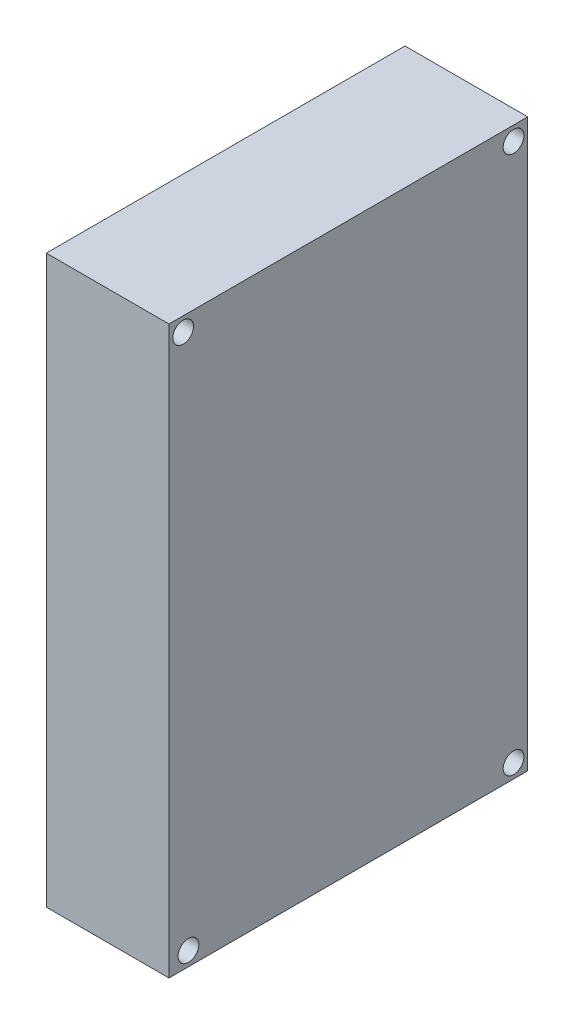
ISO-10303-21;
HEADER;
FILE_DESCRIPTION(('STEP AP214'),'2;1');
FILE_NAME('part.step','',(''),(''),'','','');
FILE_SCHEMA(('AUTOMOTIVE_DESIGN { 1 0 10303 214 1 1 1 1 }'));
ENDSEC;
DATA;
#1=APPLICATION_CONTEXT('core data for automotive mechanical design processes');
#2=APPLICATION_PROTOCOL_DEFINITION('international standard','automotive_design',2000,#1);
#3=PRODUCT_CONTEXT('',#1,'mechanical');
#4=PRODUCT('Part','Part','',(#3));
#5=PRODUCT_RELATED_PRODUCT_CATEGORY('part','',(#4));
#6=PRODUCT_DEFINITION_FORMATION('','',#4);
#7=PRODUCT_DEFINITION_CONTEXT('part definition',#1,'design');
#8=PRODUCT_DEFINITION('design','',#6,#7);
#9=PRODUCT_DEFINITION_SHAPE('','',#8);
#10=(LENGTH_UNIT() NAMED_UNIT(*) SI_UNIT(.MILLI.,.METRE.));
#11=(NAMED_UNIT(*) PLANE_ANGLE_UNIT() SI_UNIT($,.RADIAN.));
#12=(NAMED_UNIT(*) SI_UNIT($,.STERADIAN.) SOLID_ANGLE_UNIT());
#13=UNCERTAINTY_MEASURE_WITH_UNIT(LENGTH_MEASURE(1.E-05),#10,'distance_accuracy_value','');
#14=(GEOMETRIC_REPRESENTATION_CONTEXT(3) GLOBAL_UNCERTAINTY_ASSIGNED_CONTEXT((#13)) GLOBAL_UNIT_ASSIGNED_CONTEXT((#10,
#11,#12)) REPRESENTATION_CONTEXT('',''));
#15=CARTESIAN_POINT('',(0.,0.,0.));
#16=DIRECTION('',(0.,0.,1.));
#17=DIRECTION('',(1.,0.,0.));
#18=AXIS2_PLACEMENT_3D('',#15,#16,#17);
#19=CARTESIAN_POINT('',(6.5,30.,38.));
#20=DIRECTION('',(-1.,0.,0.));
#21=DIRECTION('',(0.,-1.,0.));
#22=AXIS2_PLACEMENT_3D('',#19,#20,#21);
#23=PLANE('',#22);
#24=CARTESIAN_POINT('',(6.5,-28.5,1.5));
#25=DIRECTION('',(1.,0.,0.));
#26=DIRECTION('',(0.,1.,0.));
#27=AXIS2_PLACEMENT_3D('',#24,#25,#26);
#28=CIRCLE('',#27,1.1);
#29=CARTESIAN_POINT('',(6.5,-27.4,1.5));
#30=VERTEX_POINT('',#29);
#31=EDGE_CURVE('E133',#30,#30,#28,.T.);
#32=ORIENTED_EDGE('',*,*,#31,.F.);
#33=EDGE_LOOP('',(#32));
#34=FACE_BOUND('',#33,.T.);
#35=CARTESIAN_POINT('',(6.5,-28.5,35.9388349867032));
#36=DIRECTION('',(1.,0.,0.));
#37=DIRECTION('',(0.,1.,0.));
#38=AXIS2_PLACEMENT_3D('',#35,#36,#37);
#39=CIRCLE('',#38,1.10000000000001);
#40=CARTESIAN_POINT('',(6.5,-27.4,35.9388349867032));
#41=VERTEX_POINT('',#40);
#42=EDGE_CURVE('E127',#41,#41,#39,.T.);
#43=ORIENTED_EDGE('',*,*,#42,.F.);
#44=EDGE_LOOP('',(#43));
#45=FACE_BOUND('',#44,.T.);
#46=CARTESIAN_POINT('',(6.5,28.4972375982192,36.5));
#47=DIRECTION('',(1.,0.,0.));
#48=DIRECTION('',(0.,1.,0.));
#49=AXIS2_PLACEMENT_3D('',#46,#47,#48);
#50=CIRCLE('',#49,1.10000000000001);
#51=CARTESIAN_POINT('',(6.5,29.5972375982192,36.5));
#52=VERTEX_POINT('',#51);
#53=EDGE_CURVE('E121',#52,#52,#50,.T.);
#54=ORIENTED_EDGE('',*,*,#53,.F.);
#55=EDGE_LOOP('',(#54));
#56=FACE_BOUND('',#55,.T.);
#57=CARTESIAN_POINT('',(6.5,28.4972375982192,1.5));
#58=DIRECTION('',(1.,0.,0.));
#59=DIRECTION('',(0.,1.,0.));
#60=AXIS2_PLACEMENT_3D('',#57,#58,#59);
#61=CIRCLE('',#60,1.1);
#62=CARTESIAN_POINT('',(6.5,29.5972375982192,1.5));
#63=VERTEX_POINT('',#62);
#64=EDGE_CURVE('E115',#63,#63,#61,.T.);
#65=ORIENTED_EDGE('',*,*,#64,.F.);
#66=EDGE_LOOP('',(#65));
#67=FACE_BOUND('',#66,.T.);
#68=DIRECTION('',(0.,1.,0.));
#69=VECTOR('',#68,1.);
#70=CARTESIAN_POINT('',(6.5,30.,0.));
#71=LINE('',#70,#69);
#72=CARTESIAN_POINT('',(6.5,-30.,0.));
#73=VERTEX_POINT('',#72);
#74=CARTESIAN_POINT('',(6.5,30.,0.));
#75=VERTEX_POINT('',#74);
#76=EDGE_CURVE('E101',#73,#75,#71,.T.);
#77=ORIENTED_EDGE('',*,*,#76,.T.);
#78=DIRECTION('',(0.,0.,-1.));
#79=VECTOR('',#78,1.);
#80=CARTESIAN_POINT('',(6.5,30.,38.));
#81=LINE('',#80,#79);
#82=CARTESIAN_POINT('',(6.5,30.,38.));
#83=VERTEX_POINT('',#82);
#84=EDGE_CURVE('E11',#83,#75,#81,.T.);
#85=ORIENTED_EDGE('',*,*,#84,.F.);
#86=DIRECTION('',(0.,1.,0.));
#87=VECTOR('',#86,1.);
#88=CARTESIAN_POINT('',(6.5,30.,38.));
#89=LINE('',#88,#87);
#90=CARTESIAN_POINT('',(6.5,-30.,38.));
#91=VERTEX_POINT('',#90);
#92=EDGE_CURVE('E89',#91,#83,#89,.T.);
#93=ORIENTED_EDGE('',*,*,#92,.F.);
#94=DIRECTION('',(0.,0.,-1.));
#95=VECTOR('',#94,1.);
#96=CARTESIAN_POINT('',(6.5,-30.,38.));
#97=LINE('',#96,#95);
#98=EDGE_CURVE('E97',#91,#73,#97,.T.);
#99=ORIENTED_EDGE('',*,*,#98,.T.);
#100=EDGE_LOOP('',(#77,#85,#93,#99));
#101=FACE_BOUND('',#100,.T.);
#102=ADVANCED_FACE('F38',(#34,#45,#56,#67,#101),#23,.F.);
#103=CARTESIAN_POINT('',(-6.5,30.,38.));
#104=DIRECTION('',(0.,-1.,0.));
#105=DIRECTION('',(0.,0.,-1.));
#106=AXIS2_PLACEMENT_3D('',#103,#104,#105);
#107=PLANE('',#106);
#108=DIRECTION('',(-1.,0.,0.));
#109=VECTOR('',#108,1.);
#110=CARTESIAN_POINT('',(-6.5,30.,0.));
#111=LINE('',#110,#109);
#112=CARTESIAN_POINT('',(-6.5,30.,0.));
#113=VERTEX_POINT('',#112);
#114=EDGE_CURVE('E93',#75,#113,#111,.T.);
#115=ORIENTED_EDGE('',*,*,#114,.T.);
#116=DIRECTION('',(0.,0.,-1.));
#117=VECTOR('',#116,1.);
#118=CARTESIAN_POINT('',(-6.5,30.,38.));
#119=LINE('',#118,#117);
#120=CARTESIAN_POINT('',(-6.5,30.,38.));
#121=VERTEX_POINT('',#120);
#122=EDGE_CURVE('E46',#121,#113,#119,.T.);
#123=ORIENTED_EDGE('',*,*,#122,.F.);
#124=DIRECTION('',(-1.,0.,0.));
#125=VECTOR('',#124,1.);
#126=CARTESIAN_POINT('',(-6.5,30.,38.));
#127=LINE('',#126,#125);
#128=EDGE_CURVE('E84',#83,#121,#127,.T.);
#129=ORIENTED_EDGE('',*,*,#128,.F.);
#130=ORIENTED_EDGE('',*,*,#84,.T.);
#131=EDGE_LOOP('',(#115,#123,#129,#130));
#132=FACE_BOUND('',#131,.T.);
#133=ADVANCED_FACE('F92',(#132),#107,.F.);
#134=CARTESIAN_POINT('',(-6.5,30.,38.));
#135=DIRECTION('',(1.,0.,0.));
#136=DIRECTION('',(0.,1.,0.));
#137=AXIS2_PLACEMENT_3D('',#134,#135,#136);
#138=PLANE('',#137);
#139=CARTESIAN_POINT('',(-6.50000000000001,-28.5,1.5));
#140=DIRECTION('',(1.,0.,0.));
#141=DIRECTION('',(0.,1.,0.));
#142=AXIS2_PLACEMENT_3D('',#139,#140,#141);
#143=CIRCLE('',#142,1.1);
#144=CARTESIAN_POINT('',(-6.50000000000001,-27.4,1.5));
#145=VERTEX_POINT('',#144);
#146=EDGE_CURVE('E130',#145,#145,#143,.T.);
#147=ORIENTED_EDGE('',*,*,#146,.T.);
#148=EDGE_LOOP('',(#147));
#149=FACE_BOUND('',#148,.T.);
#150=CARTESIAN_POINT('',(-6.50000000000001,-28.5,35.9388349867032));
#151=DIRECTION('',(1.,0.,0.));
#152=DIRECTION('',(0.,1.,0.));
#153=AXIS2_PLACEMENT_3D('',#150,#151,#152);
#154=CIRCLE('',#153,1.10000000000001);
#155=CARTESIAN_POINT('',(-6.50000000000001,-27.4,35.9388349867032));
#156=VERTEX_POINT('',#155);
#157=EDGE_CURVE('E124',#156,#156,#154,.T.);
#158=ORIENTED_EDGE('',*,*,#157,.T.);
#159=EDGE_LOOP('',(#158));
#160=FACE_BOUND('',#159,.T.);
#161=CARTESIAN_POINT('',(-6.50000000000001,28.4972375982192,36.5));
#162=DIRECTION('',(1.,0.,0.));
#163=DIRECTION('',(0.,1.,0.));
#164=AXIS2_PLACEMENT_3D('',#161,#162,#163);
#165=CIRCLE('',#164,1.10000000000001);
#166=CARTESIAN_POINT('',(-6.50000000000001,29.5972375982192,36.5));
#167=VERTEX_POINT('',#166);
#168=EDGE_CURVE('E118',#167,#167,#165,.T.);
#169=ORIENTED_EDGE('',*,*,#168,.T.);
#170=EDGE_LOOP('',(#169));
#171=FACE_BOUND('',#170,.T.);
#172=CARTESIAN_POINT('',(-6.50000000000001,28.4972375982192,1.5));
#173=DIRECTION('',(1.,0.,0.));
#174=DIRECTION('',(0.,1.,0.));
#175=AXIS2_PLACEMENT_3D('',#172,#173,#174);
#176=CIRCLE('',#175,1.1);
#177=CARTESIAN_POINT('',(-6.50000000000001,29.5972375982192,1.5));
#178=VERTEX_POINT('',#177);
#179=EDGE_CURVE('E104',#178,#178,#176,.T.);
#180=ORIENTED_EDGE('',*,*,#179,.T.);
#181=EDGE_LOOP('',(#180));
#182=FACE_BOUND('',#181,.T.);
#183=DIRECTION('',(0.,-1.,0.));
#184=VECTOR('',#183,1.);
#185=CARTESIAN_POINT('',(-6.5,30.,0.));
#186=LINE('',#185,#184);
#187=CARTESIAN_POINT('',(-6.5,-30.,0.));
#188=VERTEX_POINT('',#187);
#189=EDGE_CURVE('E71',#113,#188,#186,.T.);
#190=ORIENTED_EDGE('',*,*,#189,.T.);
#191=DIRECTION('',(0.,0.,-1.));
#192=VECTOR('',#191,1.);
#193=CARTESIAN_POINT('',(-6.5,-30.,38.));
#194=LINE('',#193,#192);
#195=CARTESIAN_POINT('',(-6.5,-30.,38.));
#196=VERTEX_POINT('',#195);
#197=EDGE_CURVE('E94',#196,#188,#194,.T.);
#198=ORIENTED_EDGE('',*,*,#197,.F.);
#199=DIRECTION('',(0.,-1.,0.));
#200=VECTOR('',#199,1.);
#201=CARTESIAN_POINT('',(-6.5,30.,38.));
#202=LINE('',#201,#200);
#203=EDGE_CURVE('E87',#121,#196,#202,.T.);
#204=ORIENTED_EDGE('',*,*,#203,.F.);
#205=ORIENTED_EDGE('',*,*,#122,.T.);
#206=EDGE_LOOP('',(#190,#198,#204,#205));
#207=FACE_BOUND('',#206,.T.);
#208=ADVANCED_FACE('F95',(#149,#160,#171,#182,#207),#138,.F.);
#209=CARTESIAN_POINT('',(-6.5,-30.,38.));
#210=DIRECTION('',(0.,1.,0.));
#211=DIRECTION('',(0.,0.,1.));
#212=AXIS2_PLACEMENT_3D('',#209,#210,#211);
#213=PLANE('',#212);
#214=DIRECTION('',(1.,0.,0.));
#215=VECTOR('',#214,1.);
#216=CARTESIAN_POINT('',(-6.5,-30.,0.));
#217=LINE('',#216,#215);
#218=EDGE_CURVE('E77',#188,#73,#217,.T.);
#219=ORIENTED_EDGE('',*,*,#218,.T.);
#220=ORIENTED_EDGE('',*,*,#98,.F.);
#221=DIRECTION('',(1.,0.,0.));
#222=VECTOR('',#221,1.);
#223=CARTESIAN_POINT('',(-6.5,-30.,38.));
#224=LINE('',#223,#222);
#225=EDGE_CURVE('E54',#196,#91,#224,.T.);
#226=ORIENTED_EDGE('',*,*,#225,.F.);
#227=ORIENTED_EDGE('',*,*,#197,.T.);
#228=EDGE_LOOP('',(#219,#220,#226,#227));
#229=FACE_BOUND('',#228,.T.);
#230=ADVANCED_FACE('F109',(#229),#213,.F.);
#231=CARTESIAN_POINT('',(0.,0.,38.));
#232=DIRECTION('',(0.,0.,1.));
#233=DIRECTION('',(1.,0.,0.));
#234=AXIS2_PLACEMENT_3D('',#231,#232,#233);
#235=PLANE('',#234);
#236=ORIENTED_EDGE('',*,*,#92,.T.);
#237=ORIENTED_EDGE('',*,*,#128,.T.);
#238=ORIENTED_EDGE('',*,*,#203,.T.);
#239=ORIENTED_EDGE('',*,*,#225,.T.);
#240=EDGE_LOOP('',(#236,#237,#238,#239));
#241=FACE_BOUND('',#240,.T.);
#242=ADVANCED_FACE('F85',(#241),#235,.T.);
#243=CARTESIAN_POINT('',(0.,0.,0.));
#244=DIRECTION('',(0.,0.,1.));
#245=DIRECTION('',(1.,0.,0.));
#246=AXIS2_PLACEMENT_3D('',#243,#244,#245);
#247=PLANE('',#246);
#248=ORIENTED_EDGE('',*,*,#76,.F.);
#249=ORIENTED_EDGE('',*,*,#218,.F.);
#250=ORIENTED_EDGE('',*,*,#189,.F.);
#251=ORIENTED_EDGE('',*,*,#114,.F.);
#252=EDGE_LOOP('',(#248,#249,#250,#251));
#253=FACE_BOUND('',#252,.T.);
#254=ADVANCED_FACE('F112',(#253),#247,.F.);
#255=CARTESIAN_POINT('',(-6.50000000000001,28.4972375982192,1.5));
#256=DIRECTION('',(1.,0.,0.));
#257=DIRECTION('',(0.,1.,0.));
#258=AXIS2_PLACEMENT_3D('',#255,#256,#257);
#259=CYLINDRICAL_SURFACE('',#258,1.1);
#260=ORIENTED_EDGE('',*,*,#179,.F.);
#261=EDGE_LOOP('',(#260));
#262=FACE_BOUND('',#261,.T.);
#263=ORIENTED_EDGE('',*,*,#64,.T.);
#264=EDGE_LOOP('',(#263));
#265=FACE_BOUND('',#264,.T.);
#266=ADVANCED_FACE('F156',(#262,#265),#259,.F.);
#267=CARTESIAN_POINT('',(-6.50000000000001,28.4972375982192,36.5));
#268=DIRECTION('',(1.,0.,0.));
#269=DIRECTION('',(0.,1.,0.));
#270=AXIS2_PLACEMENT_3D('',#267,#268,#269);
#271=CYLINDRICAL_SURFACE('',#270,1.10000000000001);
#272=ORIENTED_EDGE('',*,*,#168,.F.);
#273=EDGE_LOOP('',(#272));
#274=FACE_BOUND('',#273,.T.);
#275=ORIENTED_EDGE('',*,*,#53,.T.);
#276=EDGE_LOOP('',(#275));
#277=FACE_BOUND('',#276,.T.);
#278=ADVANCED_FACE('F158',(#274,#277),#271,.F.);
#279=CARTESIAN_POINT('',(-6.50000000000001,-28.5,35.9388349867032));
#280=DIRECTION('',(1.,0.,0.));
#281=DIRECTION('',(0.,1.,0.));
#282=AXIS2_PLACEMENT_3D('',#279,#280,#281);
#283=CYLINDRICAL_SURFACE('',#282,1.10000000000001);
#284=ORIENTED_EDGE('',*,*,#157,.F.);
#285=EDGE_LOOP('',(#284));
#286=FACE_BOUND('',#285,.T.);
#287=ORIENTED_EDGE('',*,*,#42,.T.);
#288=EDGE_LOOP('',(#287));
#289=FACE_BOUND('',#288,.T.);
#290=ADVANCED_FACE('F144',(#286,#289),#283,.F.);
#291=CARTESIAN_POINT('',(-6.50000000000001,-28.5,1.5));
#292=DIRECTION('',(1.,0.,0.));
#293=DIRECTION('',(0.,1.,0.));
#294=AXIS2_PLACEMENT_3D('',#291,#292,#293);
#295=CYLINDRICAL_SURFACE('',#294,1.1);
#296=ORIENTED_EDGE('',*,*,#146,.F.);
#297=EDGE_LOOP('',(#296));
#298=FACE_BOUND('',#297,.T.);
#299=ORIENTED_EDGE('',*,*,#31,.T.);
#300=EDGE_LOOP('',(#299));
#301=FACE_BOUND('',#300,.T.);
#302=ADVANCED_FACE('F141',(#298,#301),#295,.F.);
#303=CLOSED_SHELL('',(#102,#133,#208,#230,#242,#254,#266,#278,#290,#302));
#304=MANIFOLD_SOLID_BREP('B2',#303);
#305=ADVANCED_BREP_SHAPE_REPRESENTATION('',(#18,#304),#14);
#306=SHAPE_DEFINITION_REPRESENTATION(#9,#305);
ENDSEC;
END-ISO-10303-21;
